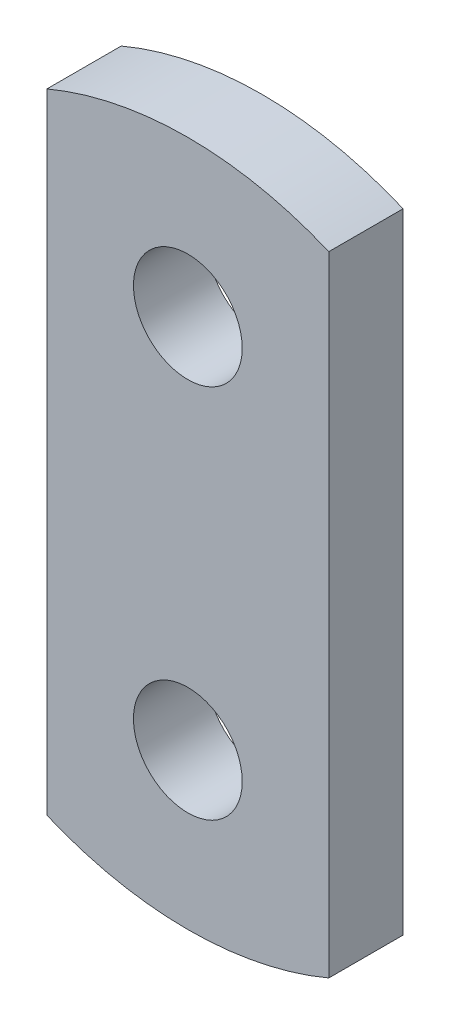
ISO-10303-21;
HEADER;
FILE_DESCRIPTION(('STEP AP214'),'2;1');
FILE_NAME('part.step','',(''),(''),'','','');
FILE_SCHEMA(('AUTOMOTIVE_DESIGN { 1 0 10303 214 1 1 1 1 }'));
ENDSEC;
DATA;
#1=APPLICATION_CONTEXT('core data for automotive mechanical design processes');
#2=APPLICATION_PROTOCOL_DEFINITION('international standard','automotive_design',2000,#1);
#3=PRODUCT_CONTEXT('',#1,'mechanical');
#4=PRODUCT('Part','Part','',(#3));
#5=PRODUCT_RELATED_PRODUCT_CATEGORY('part','',(#4));
#6=PRODUCT_DEFINITION_FORMATION('','',#4);
#7=PRODUCT_DEFINITION_CONTEXT('part definition',#1,'design');
#8=PRODUCT_DEFINITION('design','',#6,#7);
#9=PRODUCT_DEFINITION_SHAPE('','',#8);
#10=(LENGTH_UNIT() NAMED_UNIT(*) SI_UNIT(.MILLI.,.METRE.));
#11=(NAMED_UNIT(*) PLANE_ANGLE_UNIT() SI_UNIT($,.RADIAN.));
#12=(NAMED_UNIT(*) SI_UNIT($,.STERADIAN.) SOLID_ANGLE_UNIT());
#13=UNCERTAINTY_MEASURE_WITH_UNIT(LENGTH_MEASURE(1.E-05),#10,'distance_accuracy_value','');
#14=(GEOMETRIC_REPRESENTATION_CONTEXT(3) GLOBAL_UNCERTAINTY_ASSIGNED_CONTEXT((#13)) GLOBAL_UNIT_ASSIGNED_CONTEXT((#10,
#11,#12)) REPRESENTATION_CONTEXT('',''));
#15=CARTESIAN_POINT('',(0.,0.,0.));
#16=DIRECTION('',(0.,0.,1.));
#17=DIRECTION('',(1.,0.,0.));
#18=AXIS2_PLACEMENT_3D('',#15,#16,#17);
#19=CARTESIAN_POINT('',(15.55,36.8063492063492,8.2));
#20=DIRECTION('',(0.,0.,-1.));
#21=DIRECTION('',(-1.,0.,0.));
#22=AXIS2_PLACEMENT_3D('',#19,#20,#21);
#23=CYLINDRICAL_SURFACE('',#22,39.9563492063492);
#24=CARTESIAN_POINT('',(15.55,36.8063492063492,0.));
#25=DIRECTION('',(0.,0.,1.));
#26=DIRECTION('',(1.,0.,0.));
#27=AXIS2_PLACEMENT_3D('',#24,#25,#26);
#28=CIRCLE('',#27,39.9563492063492);
#29=CARTESIAN_POINT('',(0.,0.,0.));
#30=VERTEX_POINT('',#29);
#31=CARTESIAN_POINT('',(31.1,0.,0.));
#32=VERTEX_POINT('',#31);
#33=EDGE_CURVE('E107',#30,#32,#28,.T.);
#34=ORIENTED_EDGE('',*,*,#33,.T.);
#35=DIRECTION('',(0.,0.,-1.));
#36=VECTOR('',#35,1.);
#37=CARTESIAN_POINT('',(31.1,0.,8.2));
#38=LINE('',#37,#36);
#39=CARTESIAN_POINT('',(31.1,0.,8.2));
#40=VERTEX_POINT('',#39);
#41=EDGE_CURVE('E11',#40,#32,#38,.T.);
#42=ORIENTED_EDGE('',*,*,#41,.F.);
#43=CARTESIAN_POINT('',(15.55,36.8063492063492,8.2));
#44=DIRECTION('',(0.,0.,1.));
#45=DIRECTION('',(1.,0.,0.));
#46=AXIS2_PLACEMENT_3D('',#43,#44,#45);
#47=CIRCLE('',#46,39.9563492063492);
#48=CARTESIAN_POINT('',(0.,0.,8.2));
#49=VERTEX_POINT('',#48);
#50=EDGE_CURVE('E77',#49,#40,#47,.T.);
#51=ORIENTED_EDGE('',*,*,#50,.F.);
#52=DIRECTION('',(0.,0.,-1.));
#53=VECTOR('',#52,1.);
#54=CARTESIAN_POINT('',(0.,0.,8.2));
#55=LINE('',#54,#53);
#56=EDGE_CURVE('E53',#49,#30,#55,.T.);
#57=ORIENTED_EDGE('',*,*,#56,.T.);
#58=EDGE_LOOP('',(#34,#42,#51,#57));
#59=FACE_BOUND('',#58,.T.);
#60=ADVANCED_FACE('F36',(#59),#23,.T.);
#61=CARTESIAN_POINT('',(31.1,0.,8.2));
#62=DIRECTION('',(1.,0.,0.));
#63=DIRECTION('',(0.,1.,0.));
#64=AXIS2_PLACEMENT_3D('',#61,#62,#63);
#65=PLANE('',#64);
#66=DIRECTION('',(0.,-1.,0.));
#67=VECTOR('',#66,1.);
#68=CARTESIAN_POINT('',(31.1,0.,0.));
#69=LINE('',#68,#67);
#70=CARTESIAN_POINT('',(31.1,69.4,0.));
#71=VERTEX_POINT('',#70);
#72=EDGE_CURVE('E86',#71,#32,#69,.T.);
#73=ORIENTED_EDGE('',*,*,#72,.F.);
#74=DIRECTION('',(0.,0.,-1.));
#75=VECTOR('',#74,1.);
#76=CARTESIAN_POINT('',(31.1,69.4,8.2));
#77=LINE('',#76,#75);
#78=CARTESIAN_POINT('',(31.1,69.4,8.2));
#79=VERTEX_POINT('',#78);
#80=EDGE_CURVE('E45',#79,#71,#77,.T.);
#81=ORIENTED_EDGE('',*,*,#80,.F.);
#82=DIRECTION('',(0.,-1.,0.));
#83=VECTOR('',#82,1.);
#84=CARTESIAN_POINT('',(31.1,0.,8.2));
#85=LINE('',#84,#83);
#86=EDGE_CURVE('E84',#79,#40,#85,.T.);
#87=ORIENTED_EDGE('',*,*,#86,.T.);
#88=ORIENTED_EDGE('',*,*,#41,.T.);
#89=EDGE_LOOP('',(#73,#81,#87,#88));
#90=FACE_BOUND('',#89,.T.);
#91=ADVANCED_FACE('F83',(#90),#65,.T.);
#92=CARTESIAN_POINT('',(15.55,32.5936507936508,8.2));
#93=DIRECTION('',(0.,0.,-1.));
#94=DIRECTION('',(-1.,0.,0.));
#95=AXIS2_PLACEMENT_3D('',#92,#93,#94);
#96=CYLINDRICAL_SURFACE('',#95,39.9563492063492);
#97=CARTESIAN_POINT('',(15.55,32.5936507936508,0.));
#98=DIRECTION('',(0.,0.,1.));
#99=DIRECTION('',(1.,0.,0.));
#100=AXIS2_PLACEMENT_3D('',#97,#98,#99);
#101=CIRCLE('',#100,39.9563492063492);
#102=CARTESIAN_POINT('',(0.,69.4,0.));
#103=VERTEX_POINT('',#102);
#104=EDGE_CURVE('E110',#103,#71,#101,.F.);
#105=ORIENTED_EDGE('',*,*,#104,.F.);
#106=DIRECTION('',(0.,0.,-1.));
#107=VECTOR('',#106,1.);
#108=CARTESIAN_POINT('',(0.,69.4,8.2));
#109=LINE('',#108,#107);
#110=CARTESIAN_POINT('',(0.,69.4,8.2));
#111=VERTEX_POINT('',#110);
#112=EDGE_CURVE('E66',#111,#103,#109,.T.);
#113=ORIENTED_EDGE('',*,*,#112,.F.);
#114=CARTESIAN_POINT('',(15.55,32.5936507936508,8.2));
#115=DIRECTION('',(0.,0.,1.));
#116=DIRECTION('',(1.,0.,0.));
#117=AXIS2_PLACEMENT_3D('',#114,#115,#116);
#118=CIRCLE('',#117,39.9563492063492);
#119=EDGE_CURVE('E93',#111,#79,#118,.F.);
#120=ORIENTED_EDGE('',*,*,#119,.T.);
#121=ORIENTED_EDGE('',*,*,#80,.T.);
#122=EDGE_LOOP('',(#105,#113,#120,#121));
#123=FACE_BOUND('',#122,.T.);
#124=ADVANCED_FACE('F95',(#123),#96,.T.);
#125=CARTESIAN_POINT('',(0.,0.,8.2));
#126=DIRECTION('',(-1.,0.,0.));
#127=DIRECTION('',(0.,0.,1.));
#128=AXIS2_PLACEMENT_3D('',#125,#126,#127);
#129=PLANE('',#128);
#130=DIRECTION('',(0.,1.,0.));
#131=VECTOR('',#130,1.);
#132=CARTESIAN_POINT('',(0.,0.,0.));
#133=LINE('',#132,#131);
#134=EDGE_CURVE('E112',#30,#103,#133,.T.);
#135=ORIENTED_EDGE('',*,*,#134,.F.);
#136=ORIENTED_EDGE('',*,*,#56,.F.);
#137=DIRECTION('',(0.,1.,0.));
#138=VECTOR('',#137,1.);
#139=CARTESIAN_POINT('',(0.,0.,8.2));
#140=LINE('',#139,#138);
#141=EDGE_CURVE('E96',#49,#111,#140,.T.);
#142=ORIENTED_EDGE('',*,*,#141,.T.);
#143=ORIENTED_EDGE('',*,*,#112,.T.);
#144=EDGE_LOOP('',(#135,#136,#142,#143));
#145=FACE_BOUND('',#144,.T.);
#146=ADVANCED_FACE('F148',(#145),#129,.T.);
#147=CARTESIAN_POINT('',(15.55,14.,8.2));
#148=DIRECTION('',(0.,0.,-1.));
#149=DIRECTION('',(-1.,0.,0.));
#150=AXIS2_PLACEMENT_3D('',#147,#148,#149);
#151=CYLINDRICAL_SURFACE('',#150,6.);
#152=CARTESIAN_POINT('',(15.55,14.,8.2));
#153=DIRECTION('',(0.,0.,1.));
#154=DIRECTION('',(1.,0.,0.));
#155=AXIS2_PLACEMENT_3D('',#152,#153,#154);
#156=CIRCLE('',#155,6.);
#157=CARTESIAN_POINT('',(21.55,14.,8.2));
#158=VERTEX_POINT('',#157);
#159=EDGE_CURVE('E118',#158,#158,#156,.T.);
#160=ORIENTED_EDGE('',*,*,#159,.T.);
#161=EDGE_LOOP('',(#160));
#162=FACE_BOUND('',#161,.T.);
#163=CARTESIAN_POINT('',(15.55,14.,0.));
#164=DIRECTION('',(0.,0.,1.));
#165=DIRECTION('',(1.,0.,0.));
#166=AXIS2_PLACEMENT_3D('',#163,#164,#165);
#167=CIRCLE('',#166,6.);
#168=CARTESIAN_POINT('',(21.55,14.,0.));
#169=VERTEX_POINT('',#168);
#170=EDGE_CURVE('E104',#169,#169,#167,.T.);
#171=ORIENTED_EDGE('',*,*,#170,.F.);
#172=EDGE_LOOP('',(#171));
#173=FACE_BOUND('',#172,.T.);
#174=ADVANCED_FACE('F38',(#162,#173),#151,.F.);
#175=CARTESIAN_POINT('',(15.55,55.4,8.2));
#176=DIRECTION('',(0.,0.,-1.));
#177=DIRECTION('',(-1.,0.,0.));
#178=AXIS2_PLACEMENT_3D('',#175,#176,#177);
#179=CYLINDRICAL_SURFACE('',#178,6.);
#180=CARTESIAN_POINT('',(15.55,55.4,8.2));
#181=DIRECTION('',(0.,0.,1.));
#182=DIRECTION('',(1.,0.,0.));
#183=AXIS2_PLACEMENT_3D('',#180,#181,#182);
#184=CIRCLE('',#183,6.);
#185=CARTESIAN_POINT('',(21.55,55.4,8.2));
#186=VERTEX_POINT('',#185);
#187=EDGE_CURVE('E98',#186,#186,#184,.T.);
#188=ORIENTED_EDGE('',*,*,#187,.T.);
#189=EDGE_LOOP('',(#188));
#190=FACE_BOUND('',#189,.T.);
#191=CARTESIAN_POINT('',(15.55,55.4,0.));
#192=DIRECTION('',(0.,0.,1.));
#193=DIRECTION('',(1.,0.,0.));
#194=AXIS2_PLACEMENT_3D('',#191,#192,#193);
#195=CIRCLE('',#194,6.);
#196=CARTESIAN_POINT('',(21.55,55.4,0.));
#197=VERTEX_POINT('',#196);
#198=EDGE_CURVE('E115',#197,#197,#195,.T.);
#199=ORIENTED_EDGE('',*,*,#198,.F.);
#200=EDGE_LOOP('',(#199));
#201=FACE_BOUND('',#200,.T.);
#202=ADVANCED_FACE('F130',(#190,#201),#179,.F.);
#203=CARTESIAN_POINT('',(0.,0.,8.2));
#204=DIRECTION('',(0.,0.,1.));
#205=DIRECTION('',(1.,0.,0.));
#206=AXIS2_PLACEMENT_3D('',#203,#204,#205);
#207=PLANE('',#206);
#208=ORIENTED_EDGE('',*,*,#159,.F.);
#209=EDGE_LOOP('',(#208));
#210=FACE_BOUND('',#209,.T.);
#211=ORIENTED_EDGE('',*,*,#50,.T.);
#212=ORIENTED_EDGE('',*,*,#86,.F.);
#213=ORIENTED_EDGE('',*,*,#119,.F.);
#214=ORIENTED_EDGE('',*,*,#141,.F.);
#215=EDGE_LOOP('',(#211,#212,#213,#214));
#216=FACE_BOUND('',#215,.T.);
#217=ORIENTED_EDGE('',*,*,#187,.F.);
#218=EDGE_LOOP('',(#217));
#219=FACE_BOUND('',#218,.T.);
#220=ADVANCED_FACE('F91',(#210,#216,#219),#207,.T.);
#221=CARTESIAN_POINT('',(0.,0.,0.));
#222=DIRECTION('',(0.,0.,1.));
#223=DIRECTION('',(1.,0.,0.));
#224=AXIS2_PLACEMENT_3D('',#221,#222,#223);
#225=PLANE('',#224);
#226=ORIENTED_EDGE('',*,*,#170,.T.);
#227=EDGE_LOOP('',(#226));
#228=FACE_BOUND('',#227,.T.);
#229=ORIENTED_EDGE('',*,*,#33,.F.);
#230=ORIENTED_EDGE('',*,*,#134,.T.);
#231=ORIENTED_EDGE('',*,*,#104,.T.);
#232=ORIENTED_EDGE('',*,*,#72,.T.);
#233=EDGE_LOOP('',(#229,#230,#231,#232));
#234=FACE_BOUND('',#233,.T.);
#235=ORIENTED_EDGE('',*,*,#198,.T.);
#236=EDGE_LOOP('',(#235));
#237=FACE_BOUND('',#236,.T.);
#238=ADVANCED_FACE('F129',(#228,#234,#237),#225,.F.);
#239=CLOSED_SHELL('',(#60,#91,#124,#146,#174,#202,#220,#238));
#240=MANIFOLD_SOLID_BREP('B2',#239);
#241=ADVANCED_BREP_SHAPE_REPRESENTATION('',(#18,#240),#14);
#242=SHAPE_DEFINITION_REPRESENTATION(#9,#241);
ENDSEC;
END-ISO-10303-21;
